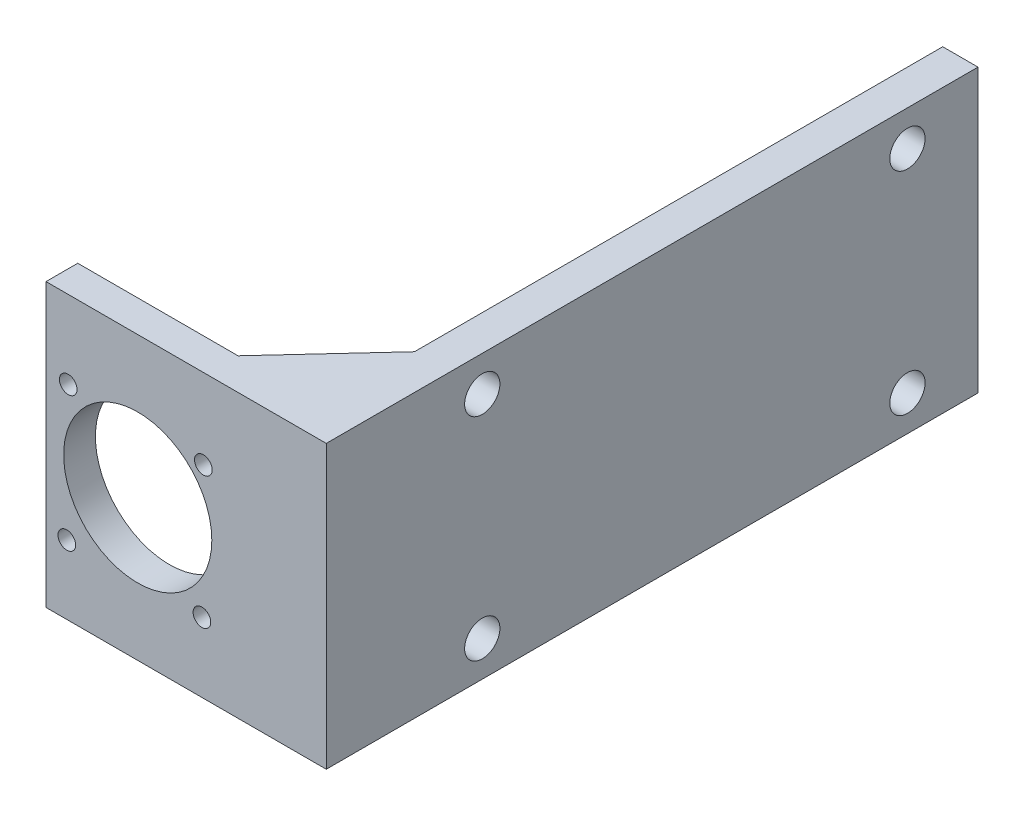
ISO-10303-21;
HEADER;
FILE_DESCRIPTION(('STEP AP214'),'2;1');
FILE_NAME('part.step','',(''),(''),'','','');
FILE_SCHEMA(('AUTOMOTIVE_DESIGN { 1 0 10303 214 1 1 1 1 }'));
ENDSEC;
DATA;
#1=APPLICATION_CONTEXT('core data for automotive mechanical design processes');
#2=APPLICATION_PROTOCOL_DEFINITION('international standard','automotive_design',2000,#1);
#3=PRODUCT_CONTEXT('',#1,'mechanical');
#4=PRODUCT('Part','Part','',(#3));
#5=PRODUCT_RELATED_PRODUCT_CATEGORY('part','',(#4));
#6=PRODUCT_DEFINITION_FORMATION('','',#4);
#7=PRODUCT_DEFINITION_CONTEXT('part definition',#1,'design');
#8=PRODUCT_DEFINITION('design','',#6,#7);
#9=PRODUCT_DEFINITION_SHAPE('','',#8);
#10=(LENGTH_UNIT() NAMED_UNIT(*) SI_UNIT(.MILLI.,.METRE.));
#11=(NAMED_UNIT(*) PLANE_ANGLE_UNIT() SI_UNIT($,.RADIAN.));
#12=(NAMED_UNIT(*) SI_UNIT($,.STERADIAN.) SOLID_ANGLE_UNIT());
#13=UNCERTAINTY_MEASURE_WITH_UNIT(LENGTH_MEASURE(1.E-05),#10,'distance_accuracy_value','');
#14=(GEOMETRIC_REPRESENTATION_CONTEXT(3) GLOBAL_UNCERTAINTY_ASSIGNED_CONTEXT((#13)) GLOBAL_UNIT_ASSIGNED_CONTEXT((#10,
#11,#12)) REPRESENTATION_CONTEXT('',''));
#15=CARTESIAN_POINT('',(0.,0.,0.));
#16=DIRECTION('',(0.,0.,1.));
#17=DIRECTION('',(1.,0.,0.));
#18=AXIS2_PLACEMENT_3D('',#15,#16,#17);
#19=CARTESIAN_POINT('',(8.71999999999915,34.,-13.));
#20=DIRECTION('',(0.734803444627488,0.,0.678280102733066));
#21=DIRECTION('',(0.678280102733066,0.,-0.734803444627488));
#22=AXIS2_PLACEMENT_3D('',#19,#20,#21);
#23=PLANE('',#22);
#24=DIRECTION('',(-0.678280102733066,0.,0.734803444627488));
#25=VECTOR('',#24,1.);
#26=CARTESIAN_POINT('',(8.71999999999915,-3.,-13.));
#27=LINE('',#26,#25);
#28=CARTESIAN_POINT('',(8.71999999999915,-3.,-13.));
#29=VERTEX_POINT('',#28);
#30=CARTESIAN_POINT('',(-3.28000000000085,-3.,0.));
#31=VERTEX_POINT('',#30);
#32=EDGE_CURVE('E118',#29,#31,#27,.T.);
#33=ORIENTED_EDGE('',*,*,#32,.F.);
#34=DIRECTION('',(0.,-1.,0.));
#35=VECTOR('',#34,1.);
#36=CARTESIAN_POINT('',(8.71999999999915,34.,-13.));
#37=LINE('',#36,#35);
#38=CARTESIAN_POINT('',(8.71999999999914,-6.,-13.));
#39=VERTEX_POINT('',#38);
#40=EDGE_CURVE('E126',#29,#39,#37,.T.);
#41=ORIENTED_EDGE('',*,*,#40,.T.);
#42=DIRECTION('',(-0.678280102733066,0.,0.734803444627488));
#43=VECTOR('',#42,1.);
#44=CARTESIAN_POINT('',(8.71999999999915,-6.00000000000001,-13.));
#45=LINE('',#44,#43);
#46=CARTESIAN_POINT('',(-3.28000000000085,-6.,0.));
#47=VERTEX_POINT('',#46);
#48=EDGE_CURVE('E121',#39,#47,#45,.T.);
#49=ORIENTED_EDGE('',*,*,#48,.T.);
#50=DIRECTION('',(0.,-1.,0.));
#51=VECTOR('',#50,1.);
#52=CARTESIAN_POINT('',(-3.28000000000085,34.,0.));
#53=LINE('',#52,#51);
#54=EDGE_CURVE('E128',#31,#47,#53,.T.);
#55=ORIENTED_EDGE('',*,*,#54,.F.);
#56=EDGE_LOOP('',(#33,#41,#49,#55));
#57=FACE_BOUND('',#56,.T.);
#58=ADVANCED_FACE('F35',(#57),#23,.F.);
#59=DIRECTION('',(0.678280102733066,0.,-0.734803444627488));
#60=VECTOR('',#59,1.);
#61=CARTESIAN_POINT('',(8.71999999999915,31.,-13.));
#62=LINE('',#61,#60);
#63=CARTESIAN_POINT('',(-3.28000000000085,31.,0.));
#64=VERTEX_POINT('',#63);
#65=CARTESIAN_POINT('',(8.71999999999915,31.,-13.));
#66=VERTEX_POINT('',#65);
#67=EDGE_CURVE('E130',#64,#66,#62,.T.);
#68=ORIENTED_EDGE('',*,*,#67,.F.);
#69=CARTESIAN_POINT('',(-3.28000000000085,34.,0.));
#70=VERTEX_POINT('',#69);
#71=EDGE_CURVE('E138',#70,#64,#53,.T.);
#72=ORIENTED_EDGE('',*,*,#71,.F.);
#73=DIRECTION('',(-0.678280102733066,0.,0.734803444627488));
#74=VECTOR('',#73,1.);
#75=CARTESIAN_POINT('',(8.71999999999915,34.,-13.));
#76=LINE('',#75,#74);
#77=CARTESIAN_POINT('',(8.71999999999915,34.,-13.));
#78=VERTEX_POINT('',#77);
#79=EDGE_CURVE('E257',#78,#70,#76,.T.);
#80=ORIENTED_EDGE('',*,*,#79,.F.);
#81=EDGE_CURVE('E137',#78,#66,#37,.T.);
#82=ORIENTED_EDGE('',*,*,#81,.T.);
#83=EDGE_LOOP('',(#68,#72,#80,#82));
#84=FACE_BOUND('',#83,.T.);
#85=ADVANCED_FACE('F275',(#84),#23,.F.);
#86=CARTESIAN_POINT('',(0.,0.,0.));
#87=DIRECTION('',(0.,0.,-1.));
#88=DIRECTION('',(-1.,0.,0.));
#89=AXIS2_PLACEMENT_3D('',#86,#87,#88);
#90=PLANE('',#89);
#91=DIRECTION('',(1.,0.,0.));
#92=VECTOR('',#91,1.);
#93=CARTESIAN_POINT('',(8.71999999999915,31.,0.));
#94=LINE('',#93,#92);
#95=CARTESIAN_POINT('',(3.71999999999915,31.,0.));
#96=VERTEX_POINT('',#95);
#97=EDGE_CURVE('E250',#64,#96,#94,.T.);
#98=ORIENTED_EDGE('',*,*,#97,.T.);
#99=DIRECTION('',(0.,-1.,0.));
#100=VECTOR('',#99,1.);
#101=CARTESIAN_POINT('',(3.71999999999914,0.,0.));
#102=LINE('',#101,#100);
#103=CARTESIAN_POINT('',(3.71999999999914,-3.,0.));
#104=VERTEX_POINT('',#103);
#105=EDGE_CURVE('E129',#96,#104,#102,.T.);
#106=ORIENTED_EDGE('',*,*,#105,.T.);
#107=DIRECTION('',(-1.,0.,0.));
#108=VECTOR('',#107,1.);
#109=CARTESIAN_POINT('',(8.71999999999915,-3.,0.));
#110=LINE('',#109,#108);
#111=EDGE_CURVE('E249',#104,#31,#110,.T.);
#112=ORIENTED_EDGE('',*,*,#111,.T.);
#113=ORIENTED_EDGE('',*,*,#54,.T.);
#114=DIRECTION('',(1.,0.,0.));
#115=VECTOR('',#114,1.);
#116=CARTESIAN_POINT('',(0.,-6.,0.));
#117=LINE('',#116,#115);
#118=CARTESIAN_POINT('',(-26.,-6.,0.));
#119=VERTEX_POINT('',#118);
#120=EDGE_CURVE('E228',#119,#47,#117,.T.);
#121=ORIENTED_EDGE('',*,*,#120,.F.);
#122=DIRECTION('',(0.,-1.,0.));
#123=VECTOR('',#122,1.);
#124=CARTESIAN_POINT('',(-26.,-6.,0.));
#125=LINE('',#124,#123);
#126=CARTESIAN_POINT('',(-26.,34.,0.));
#127=VERTEX_POINT('',#126);
#128=EDGE_CURVE('E212',#127,#119,#125,.T.);
#129=ORIENTED_EDGE('',*,*,#128,.F.);
#130=DIRECTION('',(-1.,0.,0.));
#131=VECTOR('',#130,1.);
#132=CARTESIAN_POINT('',(-26.,34.,0.));
#133=LINE('',#132,#131);
#134=EDGE_CURVE('E219',#70,#127,#133,.T.);
#135=ORIENTED_EDGE('',*,*,#134,.F.);
#136=ORIENTED_EDGE('',*,*,#71,.T.);
#137=EDGE_LOOP('',(#98,#106,#112,#113,#121,#129,#135,#136));
#138=FACE_BOUND('',#137,.T.);
#139=CARTESIAN_POINT('',(-13.,14.,0.));
#140=DIRECTION('',(0.,0.,1.));
#141=DIRECTION('',(1.,0.,0.));
#142=AXIS2_PLACEMENT_3D('',#139,#140,#141);
#143=CIRCLE('',#142,10.5);
#144=CARTESIAN_POINT('',(-2.5,14.,0.));
#145=VERTEX_POINT('',#144);
#146=EDGE_CURVE('E206',#145,#145,#143,.T.);
#147=ORIENTED_EDGE('',*,*,#146,.T.);
#148=EDGE_LOOP('',(#147));
#149=FACE_BOUND('',#148,.T.);
#150=CARTESIAN_POINT('',(-3.9,3.85,0.));
#151=DIRECTION('',(0.,0.,1.));
#152=DIRECTION('',(1.,0.,0.));
#153=AXIS2_PLACEMENT_3D('',#150,#151,#152);
#154=CIRCLE('',#153,1.25);
#155=CARTESIAN_POINT('',(-2.65,3.85,0.));
#156=VERTEX_POINT('',#155);
#157=EDGE_CURVE('E200',#156,#156,#154,.T.);
#158=ORIENTED_EDGE('',*,*,#157,.T.);
#159=EDGE_LOOP('',(#158));
#160=FACE_BOUND('',#159,.T.);
#161=CARTESIAN_POINT('',(-22.85,22.95,0.));
#162=DIRECTION('',(0.,0.,1.));
#163=DIRECTION('',(1.,0.,0.));
#164=AXIS2_PLACEMENT_3D('',#161,#162,#163);
#165=CIRCLE('',#164,1.25);
#166=CARTESIAN_POINT('',(-21.6,22.95,0.));
#167=VERTEX_POINT('',#166);
#168=EDGE_CURVE('E188',#167,#167,#165,.T.);
#169=ORIENTED_EDGE('',*,*,#168,.T.);
#170=EDGE_LOOP('',(#169));
#171=FACE_BOUND('',#170,.T.);
#172=CARTESIAN_POINT('',(-23.05,3.75,0.));
#173=DIRECTION('',(0.,0.,1.));
#174=DIRECTION('',(1.,0.,0.));
#175=AXIS2_PLACEMENT_3D('',#172,#173,#174);
#176=CIRCLE('',#175,1.25);
#177=CARTESIAN_POINT('',(-21.8,3.75,0.));
#178=VERTEX_POINT('',#177);
#179=EDGE_CURVE('E194',#178,#178,#176,.T.);
#180=ORIENTED_EDGE('',*,*,#179,.T.);
#181=EDGE_LOOP('',(#180));
#182=FACE_BOUND('',#181,.T.);
#183=CARTESIAN_POINT('',(-3.7,22.65,0.));
#184=DIRECTION('',(0.,0.,1.));
#185=DIRECTION('',(1.,0.,0.));
#186=AXIS2_PLACEMENT_3D('',#183,#184,#185);
#187=CIRCLE('',#186,1.25);
#188=CARTESIAN_POINT('',(-2.45,22.65,0.));
#189=VERTEX_POINT('',#188);
#190=EDGE_CURVE('E179',#189,#189,#187,.T.);
#191=ORIENTED_EDGE('',*,*,#190,.T.);
#192=EDGE_LOOP('',(#191));
#193=FACE_BOUND('',#192,.T.);
#194=ADVANCED_FACE('F247',(#138,#149,#160,#171,#182,#193),#90,.T.);
#195=CARTESIAN_POINT('',(8.71999999999915,34.,-128.181096139102));
#196=DIRECTION('',(1.,0.,0.));
#197=DIRECTION('',(0.,1.,0.));
#198=AXIS2_PLACEMENT_3D('',#195,#196,#197);
#199=PLANE('',#198);
#200=CARTESIAN_POINT('',(8.71999999999915,29.0000000000111,-77.8698073976093));
#201=DIRECTION('',(-1.,0.,0.));
#202=DIRECTION('',(0.,-1.,0.));
#203=AXIS2_PLACEMENT_3D('',#200,#201,#202);
#204=CIRCLE('',#203,2.50000000000662);
#205=CARTESIAN_POINT('',(8.71999999999915,26.5000000000045,-77.8698073976093));
#206=VERTEX_POINT('',#205);
#207=EDGE_CURVE('E149',#206,#206,#204,.T.);
#208=ORIENTED_EDGE('',*,*,#207,.F.);
#209=EDGE_LOOP('',(#208));
#210=FACE_BOUND('',#209,.T.);
#211=CARTESIAN_POINT('',(8.71999999999914,-0.999999999988845,-77.8698073976093));
#212=DIRECTION('',(-1.,0.,0.));
#213=DIRECTION('',(0.,-1.,0.));
#214=AXIS2_PLACEMENT_3D('',#211,#212,#213);
#215=CIRCLE('',#214,2.50000000000662);
#216=CARTESIAN_POINT('',(8.71999999999914,-3.49999999999546,-77.8698073976093));
#217=VERTEX_POINT('',#216);
#218=EDGE_CURVE('E150',#217,#217,#215,.T.);
#219=ORIENTED_EDGE('',*,*,#218,.F.);
#220=EDGE_LOOP('',(#219));
#221=FACE_BOUND('',#220,.T.);
#222=CARTESIAN_POINT('',(8.71999999999914,-0.999999999988859,-17.6098073976093));
#223=DIRECTION('',(-1.,0.,0.));
#224=DIRECTION('',(0.,-1.,0.));
#225=AXIS2_PLACEMENT_3D('',#222,#223,#224);
#226=CIRCLE('',#225,2.50000000000658);
#227=CARTESIAN_POINT('',(8.71999999999914,-3.49999999999543,-17.6098073976093));
#228=VERTEX_POINT('',#227);
#229=EDGE_CURVE('E156',#228,#228,#226,.T.);
#230=ORIENTED_EDGE('',*,*,#229,.F.);
#231=EDGE_LOOP('',(#230));
#232=FACE_BOUND('',#231,.T.);
#233=CARTESIAN_POINT('',(8.71999999999915,29.0000000000111,-17.6098073976093));
#234=DIRECTION('',(-1.,0.,0.));
#235=DIRECTION('',(0.,-1.,0.));
#236=AXIS2_PLACEMENT_3D('',#233,#234,#235);
#237=CIRCLE('',#236,2.50000000000659);
#238=CARTESIAN_POINT('',(8.71999999999915,26.5000000000046,-17.6098073976093));
#239=VERTEX_POINT('',#238);
#240=EDGE_CURVE('E141',#239,#239,#237,.T.);
#241=ORIENTED_EDGE('',*,*,#240,.F.);
#242=EDGE_LOOP('',(#241));
#243=FACE_BOUND('',#242,.T.);
#244=DIRECTION('',(0.,0.,1.));
#245=VECTOR('',#244,1.);
#246=CARTESIAN_POINT('',(8.71999999999915,-3.,-13.));
#247=LINE('',#246,#245);
#248=CARTESIAN_POINT('',(8.71999999999915,-3.,-5.));
#249=VERTEX_POINT('',#248);
#250=EDGE_CURVE('E115',#29,#249,#247,.T.);
#251=ORIENTED_EDGE('',*,*,#250,.T.);
#252=DIRECTION('',(0.,-1.,0.));
#253=VECTOR('',#252,1.);
#254=CARTESIAN_POINT('',(8.71999999999915,34.,-5.));
#255=LINE('',#254,#253);
#256=CARTESIAN_POINT('',(8.71999999999915,31.,-5.));
#257=VERTEX_POINT('',#256);
#258=EDGE_CURVE('E43',#249,#257,#255,.F.);
#259=ORIENTED_EDGE('',*,*,#258,.T.);
#260=DIRECTION('',(0.,0.,1.));
#261=VECTOR('',#260,1.);
#262=CARTESIAN_POINT('',(8.71999999999915,31.,-13.));
#263=LINE('',#262,#261);
#264=EDGE_CURVE('E122',#66,#257,#263,.T.);
#265=ORIENTED_EDGE('',*,*,#264,.F.);
#266=ORIENTED_EDGE('',*,*,#81,.F.);
#267=DIRECTION('',(0.,0.,1.));
#268=VECTOR('',#267,1.);
#269=CARTESIAN_POINT('',(8.71999999999915,34.,-128.181096139102));
#270=LINE('',#269,#268);
#271=CARTESIAN_POINT('',(8.71999999999915,34.,-87.8698073976093));
#272=VERTEX_POINT('',#271);
#273=EDGE_CURVE('E167',#272,#78,#270,.T.);
#274=ORIENTED_EDGE('',*,*,#273,.F.);
#275=DIRECTION('',(0.,-1.,0.));
#276=VECTOR('',#275,1.);
#277=CARTESIAN_POINT('',(8.71999999999915,34.,-87.8698073976093));
#278=LINE('',#277,#276);
#279=CARTESIAN_POINT('',(8.71999999999914,-6.,-87.8698073976093));
#280=VERTEX_POINT('',#279);
#281=EDGE_CURVE('E170',#272,#280,#278,.T.);
#282=ORIENTED_EDGE('',*,*,#281,.T.);
#283=DIRECTION('',(0.,0.,1.));
#284=VECTOR('',#283,1.);
#285=CARTESIAN_POINT('',(8.71999999999914,-6.,-128.181096139102));
#286=LINE('',#285,#284);
#287=EDGE_CURVE('E135',#280,#39,#286,.T.);
#288=ORIENTED_EDGE('',*,*,#287,.T.);
#289=ORIENTED_EDGE('',*,*,#40,.F.);
#290=EDGE_LOOP('',(#251,#259,#265,#266,#274,#282,#288,#289));
#291=FACE_BOUND('',#290,.T.);
#292=ADVANCED_FACE('F132',(#210,#221,#232,#243,#291),#199,.F.);
#293=CARTESIAN_POINT('',(0.,0.,4.5));
#294=DIRECTION('',(0.,0.,-1.));
#295=DIRECTION('',(-1.,0.,0.));
#296=AXIS2_PLACEMENT_3D('',#293,#294,#295);
#297=PLANE('',#296);
#298=DIRECTION('',(0.,-1.,0.));
#299=VECTOR('',#298,1.);
#300=CARTESIAN_POINT('',(-26.,-6.,4.5));
#301=LINE('',#300,#299);
#302=CARTESIAN_POINT('',(-26.,34.,4.5));
#303=VERTEX_POINT('',#302);
#304=CARTESIAN_POINT('',(-26.,-6.,4.5));
#305=VERTEX_POINT('',#304);
#306=EDGE_CURVE('E215',#303,#305,#301,.T.);
#307=ORIENTED_EDGE('',*,*,#306,.T.);
#308=DIRECTION('',(1.,0.,0.));
#309=VECTOR('',#308,1.);
#310=CARTESIAN_POINT('',(-26.,-6.,4.5));
#311=LINE('',#310,#309);
#312=CARTESIAN_POINT('',(13.7199999999991,-6.,4.5));
#313=VERTEX_POINT('',#312);
#314=EDGE_CURVE('E218',#305,#313,#311,.T.);
#315=ORIENTED_EDGE('',*,*,#314,.T.);
#316=DIRECTION('',(0.,1.,0.));
#317=VECTOR('',#316,1.);
#318=CARTESIAN_POINT('',(13.7199999999991,-6.,4.5));
#319=LINE('',#318,#317);
#320=CARTESIAN_POINT('',(13.7199999999991,34.,4.5));
#321=VERTEX_POINT('',#320);
#322=EDGE_CURVE('E221',#313,#321,#319,.T.);
#323=ORIENTED_EDGE('',*,*,#322,.T.);
#324=DIRECTION('',(-1.,0.,0.));
#325=VECTOR('',#324,1.);
#326=CARTESIAN_POINT('',(0.,34.,4.5));
#327=LINE('',#326,#325);
#328=EDGE_CURVE('E223',#321,#303,#327,.T.);
#329=ORIENTED_EDGE('',*,*,#328,.T.);
#330=EDGE_LOOP('',(#307,#315,#323,#329));
#331=FACE_BOUND('',#330,.T.);
#332=CARTESIAN_POINT('',(-13.,14.,4.5));
#333=DIRECTION('',(0.,0.,1.));
#334=DIRECTION('',(1.,0.,0.));
#335=AXIS2_PLACEMENT_3D('',#332,#333,#334);
#336=CIRCLE('',#335,10.5);
#337=CARTESIAN_POINT('',(-2.5,14.,4.5));
#338=VERTEX_POINT('',#337);
#339=EDGE_CURVE('E209',#338,#338,#336,.T.);
#340=ORIENTED_EDGE('',*,*,#339,.F.);
#341=EDGE_LOOP('',(#340));
#342=FACE_BOUND('',#341,.T.);
#343=CARTESIAN_POINT('',(-3.9,3.85,4.5));
#344=DIRECTION('',(0.,0.,1.));
#345=DIRECTION('',(1.,0.,0.));
#346=AXIS2_PLACEMENT_3D('',#343,#344,#345);
#347=CIRCLE('',#346,1.25);
#348=CARTESIAN_POINT('',(-2.65,3.85,4.5));
#349=VERTEX_POINT('',#348);
#350=EDGE_CURVE('E203',#349,#349,#347,.T.);
#351=ORIENTED_EDGE('',*,*,#350,.F.);
#352=EDGE_LOOP('',(#351));
#353=FACE_BOUND('',#352,.T.);
#354=CARTESIAN_POINT('',(-23.05,3.75,4.5));
#355=DIRECTION('',(0.,0.,1.));
#356=DIRECTION('',(1.,0.,0.));
#357=AXIS2_PLACEMENT_3D('',#354,#355,#356);
#358=CIRCLE('',#357,1.25);
#359=CARTESIAN_POINT('',(-21.8,3.75,4.5));
#360=VERTEX_POINT('',#359);
#361=EDGE_CURVE('E197',#360,#360,#358,.T.);
#362=ORIENTED_EDGE('',*,*,#361,.F.);
#363=EDGE_LOOP('',(#362));
#364=FACE_BOUND('',#363,.T.);
#365=CARTESIAN_POINT('',(-22.85,22.95,4.5));
#366=DIRECTION('',(0.,0.,1.));
#367=DIRECTION('',(1.,0.,0.));
#368=AXIS2_PLACEMENT_3D('',#365,#366,#367);
#369=CIRCLE('',#368,1.25);
#370=CARTESIAN_POINT('',(-21.6,22.95,4.5));
#371=VERTEX_POINT('',#370);
#372=EDGE_CURVE('E191',#371,#371,#369,.T.);
#373=ORIENTED_EDGE('',*,*,#372,.F.);
#374=EDGE_LOOP('',(#373));
#375=FACE_BOUND('',#374,.T.);
#376=CARTESIAN_POINT('',(-3.7,22.65,4.5));
#377=DIRECTION('',(0.,0.,1.));
#378=DIRECTION('',(1.,0.,0.));
#379=AXIS2_PLACEMENT_3D('',#376,#377,#378);
#380=CIRCLE('',#379,1.25);
#381=CARTESIAN_POINT('',(-2.45,22.65,4.5));
#382=VERTEX_POINT('',#381);
#383=EDGE_CURVE('E185',#382,#382,#380,.T.);
#384=ORIENTED_EDGE('',*,*,#383,.F.);
#385=EDGE_LOOP('',(#384));
#386=FACE_BOUND('',#385,.T.);
#387=ADVANCED_FACE('F288',(#331,#342,#353,#364,#375,#386),#297,.F.);
#388=CARTESIAN_POINT('',(-26.,-6.,4.5));
#389=DIRECTION('',(1.,0.,0.));
#390=DIRECTION('',(0.,0.,-1.));
#391=AXIS2_PLACEMENT_3D('',#388,#389,#390);
#392=PLANE('',#391);
#393=ORIENTED_EDGE('',*,*,#128,.T.);
#394=DIRECTION('',(0.,0.,-1.));
#395=VECTOR('',#394,1.);
#396=CARTESIAN_POINT('',(-26.,-6.,4.5));
#397=LINE('',#396,#395);
#398=EDGE_CURVE('E238',#305,#119,#397,.T.);
#399=ORIENTED_EDGE('',*,*,#398,.F.);
#400=ORIENTED_EDGE('',*,*,#306,.F.);
#401=DIRECTION('',(0.,0.,-1.));
#402=VECTOR('',#401,1.);
#403=CARTESIAN_POINT('',(-26.,34.,4.5));
#404=LINE('',#403,#402);
#405=EDGE_CURVE('E225',#303,#127,#404,.T.);
#406=ORIENTED_EDGE('',*,*,#405,.T.);
#407=EDGE_LOOP('',(#393,#399,#400,#406));
#408=FACE_BOUND('',#407,.T.);
#409=ADVANCED_FACE('F264',(#408),#392,.F.);
#410=CARTESIAN_POINT('',(0.,-6.,4.5));
#411=DIRECTION('',(0.,1.,0.));
#412=DIRECTION('',(0.,0.,1.));
#413=AXIS2_PLACEMENT_3D('',#410,#411,#412);
#414=PLANE('',#413);
#415=ORIENTED_EDGE('',*,*,#120,.T.);
#416=ORIENTED_EDGE('',*,*,#48,.F.);
#417=ORIENTED_EDGE('',*,*,#287,.F.);
#418=DIRECTION('',(1.,0.,0.));
#419=VECTOR('',#418,1.);
#420=CARTESIAN_POINT('',(13.7199999999991,-6.,-87.8698073976093));
#421=LINE('',#420,#419);
#422=CARTESIAN_POINT('',(13.7199999999991,-6.,-87.8698073976093));
#423=VERTEX_POINT('',#422);
#424=EDGE_CURVE('E172',#280,#423,#421,.T.);
#425=ORIENTED_EDGE('',*,*,#424,.T.);
#426=DIRECTION('',(0.,0.,-1.));
#427=VECTOR('',#426,1.);
#428=CARTESIAN_POINT('',(13.7199999999991,-6.,4.5));
#429=LINE('',#428,#427);
#430=EDGE_CURVE('E236',#313,#423,#429,.T.);
#431=ORIENTED_EDGE('',*,*,#430,.F.);
#432=ORIENTED_EDGE('',*,*,#314,.F.);
#433=ORIENTED_EDGE('',*,*,#398,.T.);
#434=EDGE_LOOP('',(#415,#416,#417,#425,#431,#432,#433));
#435=FACE_BOUND('',#434,.T.);
#436=ADVANCED_FACE('F260',(#435),#414,.F.);
#437=CARTESIAN_POINT('',(13.7199999999991,-6.,4.5));
#438=DIRECTION('',(-1.,0.,0.));
#439=DIRECTION('',(0.,0.,1.));
#440=AXIS2_PLACEMENT_3D('',#437,#438,#439);
#441=PLANE('',#440);
#442=CARTESIAN_POINT('',(13.7199999999992,29.0000000000111,-17.6098073976093));
#443=DIRECTION('',(-1.,0.,0.));
#444=DIRECTION('',(0.,-1.,0.));
#445=AXIS2_PLACEMENT_3D('',#442,#443,#444);
#446=CIRCLE('',#445,2.50000000000659);
#447=CARTESIAN_POINT('',(13.7199999999992,26.5000000000046,-17.6098073976093));
#448=VERTEX_POINT('',#447);
#449=EDGE_CURVE('E159',#448,#448,#446,.T.);
#450=ORIENTED_EDGE('',*,*,#449,.T.);
#451=EDGE_LOOP('',(#450));
#452=FACE_BOUND('',#451,.T.);
#453=CARTESIAN_POINT('',(13.7199999999991,-0.99999999998886,-17.6098073976093));
#454=DIRECTION('',(-1.,0.,0.));
#455=DIRECTION('',(0.,-1.,0.));
#456=AXIS2_PLACEMENT_3D('',#453,#454,#455);
#457=CIRCLE('',#456,2.50000000000658);
#458=CARTESIAN_POINT('',(13.7199999999991,-3.49999999999544,-17.6098073976093));
#459=VERTEX_POINT('',#458);
#460=EDGE_CURVE('E153',#459,#459,#457,.T.);
#461=ORIENTED_EDGE('',*,*,#460,.T.);
#462=EDGE_LOOP('',(#461));
#463=FACE_BOUND('',#462,.T.);
#464=CARTESIAN_POINT('',(13.7199999999991,-0.999999999988846,-77.8698073976093));
#465=DIRECTION('',(-1.,0.,0.));
#466=DIRECTION('',(0.,-1.,0.));
#467=AXIS2_PLACEMENT_3D('',#464,#465,#466);
#468=CIRCLE('',#467,2.50000000000662);
#469=CARTESIAN_POINT('',(13.7199999999991,-3.49999999999546,-77.8698073976093));
#470=VERTEX_POINT('',#469);
#471=EDGE_CURVE('E146',#470,#470,#468,.T.);
#472=ORIENTED_EDGE('',*,*,#471,.T.);
#473=EDGE_LOOP('',(#472));
#474=FACE_BOUND('',#473,.T.);
#475=CARTESIAN_POINT('',(13.7199999999992,29.0000000000111,-77.8698073976093));
#476=DIRECTION('',(-1.,0.,0.));
#477=DIRECTION('',(0.,-1.,0.));
#478=AXIS2_PLACEMENT_3D('',#475,#476,#477);
#479=CIRCLE('',#478,2.50000000000662);
#480=CARTESIAN_POINT('',(13.7199999999992,26.5000000000045,-77.8698073976093));
#481=VERTEX_POINT('',#480);
#482=EDGE_CURVE('E164',#481,#481,#479,.T.);
#483=ORIENTED_EDGE('',*,*,#482,.T.);
#484=EDGE_LOOP('',(#483));
#485=FACE_BOUND('',#484,.T.);
#486=ORIENTED_EDGE('',*,*,#430,.T.);
#487=DIRECTION('',(0.,1.,0.));
#488=VECTOR('',#487,1.);
#489=CARTESIAN_POINT('',(13.7199999999991,34.,-87.8698073976093));
#490=LINE('',#489,#488);
#491=CARTESIAN_POINT('',(13.7199999999991,34.,-87.8698073976093));
#492=VERTEX_POINT('',#491);
#493=EDGE_CURVE('E176',#423,#492,#490,.T.);
#494=ORIENTED_EDGE('',*,*,#493,.T.);
#495=DIRECTION('',(0.,0.,-1.));
#496=VECTOR('',#495,1.);
#497=CARTESIAN_POINT('',(13.7199999999991,34.,4.5));
#498=LINE('',#497,#496);
#499=EDGE_CURVE('E234',#321,#492,#498,.T.);
#500=ORIENTED_EDGE('',*,*,#499,.F.);
#501=ORIENTED_EDGE('',*,*,#322,.F.);
#502=EDGE_LOOP('',(#486,#494,#500,#501));
#503=FACE_BOUND('',#502,.T.);
#504=ADVANCED_FACE('F284',(#452,#463,#474,#485,#503),#441,.F.);
#505=CARTESIAN_POINT('',(-26.,34.,4.5));
#506=DIRECTION('',(0.,-1.,0.));
#507=DIRECTION('',(0.,0.,-1.));
#508=AXIS2_PLACEMENT_3D('',#505,#506,#507);
#509=PLANE('',#508);
#510=ORIENTED_EDGE('',*,*,#79,.T.);
#511=ORIENTED_EDGE('',*,*,#134,.T.);
#512=ORIENTED_EDGE('',*,*,#405,.F.);
#513=ORIENTED_EDGE('',*,*,#328,.F.);
#514=ORIENTED_EDGE('',*,*,#499,.T.);
#515=DIRECTION('',(-1.,0.,0.));
#516=VECTOR('',#515,1.);
#517=CARTESIAN_POINT('',(13.7199999999991,34.,-87.8698073976093));
#518=LINE('',#517,#516);
#519=EDGE_CURVE('E173',#492,#272,#518,.T.);
#520=ORIENTED_EDGE('',*,*,#519,.T.);
#521=ORIENTED_EDGE('',*,*,#273,.T.);
#522=EDGE_LOOP('',(#510,#511,#512,#513,#514,#520,#521));
#523=FACE_BOUND('',#522,.T.);
#524=ADVANCED_FACE('F269',(#523),#509,.F.);
#525=CARTESIAN_POINT('',(-13.,14.,4.5));
#526=DIRECTION('',(0.,0.,-1.));
#527=DIRECTION('',(-1.,0.,0.));
#528=AXIS2_PLACEMENT_3D('',#525,#526,#527);
#529=CYLINDRICAL_SURFACE('',#528,10.5);
#530=ORIENTED_EDGE('',*,*,#339,.T.);
#531=EDGE_LOOP('',(#530));
#532=FACE_BOUND('',#531,.T.);
#533=ORIENTED_EDGE('',*,*,#146,.F.);
#534=EDGE_LOOP('',(#533));
#535=FACE_BOUND('',#534,.T.);
#536=ADVANCED_FACE('F353',(#532,#535),#529,.F.);
#537=CARTESIAN_POINT('',(-3.9,3.85,4.5));
#538=DIRECTION('',(0.,0.,-1.));
#539=DIRECTION('',(-1.,0.,0.));
#540=AXIS2_PLACEMENT_3D('',#537,#538,#539);
#541=CYLINDRICAL_SURFACE('',#540,1.25);
#542=ORIENTED_EDGE('',*,*,#350,.T.);
#543=EDGE_LOOP('',(#542));
#544=FACE_BOUND('',#543,.T.);
#545=ORIENTED_EDGE('',*,*,#157,.F.);
#546=EDGE_LOOP('',(#545));
#547=FACE_BOUND('',#546,.T.);
#548=ADVANCED_FACE('F349',(#544,#547),#541,.F.);
#549=CARTESIAN_POINT('',(-23.05,3.75,4.5));
#550=DIRECTION('',(0.,0.,-1.));
#551=DIRECTION('',(-1.,0.,0.));
#552=AXIS2_PLACEMENT_3D('',#549,#550,#551);
#553=CYLINDRICAL_SURFACE('',#552,1.25);
#554=ORIENTED_EDGE('',*,*,#361,.T.);
#555=EDGE_LOOP('',(#554));
#556=FACE_BOUND('',#555,.T.);
#557=ORIENTED_EDGE('',*,*,#179,.F.);
#558=EDGE_LOOP('',(#557));
#559=FACE_BOUND('',#558,.T.);
#560=ADVANCED_FACE('F345',(#556,#559),#553,.F.);
#561=CARTESIAN_POINT('',(-22.85,22.95,4.5));
#562=DIRECTION('',(0.,0.,-1.));
#563=DIRECTION('',(-1.,0.,0.));
#564=AXIS2_PLACEMENT_3D('',#561,#562,#563);
#565=CYLINDRICAL_SURFACE('',#564,1.25);
#566=ORIENTED_EDGE('',*,*,#372,.T.);
#567=EDGE_LOOP('',(#566));
#568=FACE_BOUND('',#567,.T.);
#569=ORIENTED_EDGE('',*,*,#168,.F.);
#570=EDGE_LOOP('',(#569));
#571=FACE_BOUND('',#570,.T.);
#572=ADVANCED_FACE('F305',(#568,#571),#565,.F.);
#573=CARTESIAN_POINT('',(-3.7,22.65,4.5));
#574=DIRECTION('',(0.,0.,-1.));
#575=DIRECTION('',(-1.,0.,0.));
#576=AXIS2_PLACEMENT_3D('',#573,#574,#575);
#577=CYLINDRICAL_SURFACE('',#576,1.25);
#578=ORIENTED_EDGE('',*,*,#383,.T.);
#579=EDGE_LOOP('',(#578));
#580=FACE_BOUND('',#579,.T.);
#581=ORIENTED_EDGE('',*,*,#190,.F.);
#582=EDGE_LOOP('',(#581));
#583=FACE_BOUND('',#582,.T.);
#584=ADVANCED_FACE('F302',(#580,#583),#577,.F.);
#585=CARTESIAN_POINT('',(13.7200000000006,-35.9999999999889,-87.8698073976093));
#586=DIRECTION('',(0.,0.,1.));
#587=DIRECTION('',(1.,0.,0.));
#588=AXIS2_PLACEMENT_3D('',#585,#586,#587);
#589=PLANE('',#588);
#590=ORIENTED_EDGE('',*,*,#424,.F.);
#591=ORIENTED_EDGE('',*,*,#281,.F.);
#592=ORIENTED_EDGE('',*,*,#519,.F.);
#593=ORIENTED_EDGE('',*,*,#493,.F.);
#594=EDGE_LOOP('',(#590,#591,#592,#593));
#595=FACE_BOUND('',#594,.T.);
#596=ADVANCED_FACE('F282',(#595),#589,.F.);
#597=CARTESIAN_POINT('',(13.7199999999992,29.0000000000111,-77.8698073976093));
#598=DIRECTION('',(-1.,0.,0.));
#599=DIRECTION('',(0.,-1.,0.));
#600=AXIS2_PLACEMENT_3D('',#597,#598,#599);
#601=CYLINDRICAL_SURFACE('',#600,2.50000000000662);
#602=ORIENTED_EDGE('',*,*,#482,.F.);
#603=EDGE_LOOP('',(#602));
#604=FACE_BOUND('',#603,.T.);
#605=ORIENTED_EDGE('',*,*,#207,.T.);
#606=EDGE_LOOP('',(#605));
#607=FACE_BOUND('',#606,.T.);
#608=ADVANCED_FACE('F329',(#604,#607),#601,.F.);
#609=CARTESIAN_POINT('',(13.7199999999991,-0.999999999988846,-77.8698073976093));
#610=DIRECTION('',(-1.,0.,0.));
#611=DIRECTION('',(0.,-1.,0.));
#612=AXIS2_PLACEMENT_3D('',#609,#610,#611);
#613=CYLINDRICAL_SURFACE('',#612,2.50000000000662);
#614=ORIENTED_EDGE('',*,*,#471,.F.);
#615=EDGE_LOOP('',(#614));
#616=FACE_BOUND('',#615,.T.);
#617=ORIENTED_EDGE('',*,*,#218,.T.);
#618=EDGE_LOOP('',(#617));
#619=FACE_BOUND('',#618,.T.);
#620=ADVANCED_FACE('F325',(#616,#619),#613,.F.);
#621=CARTESIAN_POINT('',(13.7199999999991,-0.99999999998886,-17.6098073976093));
#622=DIRECTION('',(-1.,0.,0.));
#623=DIRECTION('',(0.,-1.,0.));
#624=AXIS2_PLACEMENT_3D('',#621,#622,#623);
#625=CYLINDRICAL_SURFACE('',#624,2.50000000000658);
#626=ORIENTED_EDGE('',*,*,#460,.F.);
#627=EDGE_LOOP('',(#626));
#628=FACE_BOUND('',#627,.T.);
#629=ORIENTED_EDGE('',*,*,#229,.T.);
#630=EDGE_LOOP('',(#629));
#631=FACE_BOUND('',#630,.T.);
#632=ADVANCED_FACE('F328',(#628,#631),#625,.F.);
#633=CARTESIAN_POINT('',(13.7199999999992,29.0000000000111,-17.6098073976093));
#634=DIRECTION('',(-1.,0.,0.));
#635=DIRECTION('',(0.,-1.,0.));
#636=AXIS2_PLACEMENT_3D('',#633,#634,#635);
#637=CYLINDRICAL_SURFACE('',#636,2.50000000000659);
#638=ORIENTED_EDGE('',*,*,#449,.F.);
#639=EDGE_LOOP('',(#638));
#640=FACE_BOUND('',#639,.T.);
#641=ORIENTED_EDGE('',*,*,#240,.T.);
#642=EDGE_LOOP('',(#641));
#643=FACE_BOUND('',#642,.T.);
#644=ADVANCED_FACE('F333',(#640,#643),#637,.F.);
#645=CARTESIAN_POINT('',(8.71999999999915,-3.,-13.));
#646=DIRECTION('',(0.,1.,0.));
#647=DIRECTION('',(-1.,0.,0.));
#648=AXIS2_PLACEMENT_3D('',#645,#646,#647);
#649=PLANE('',#648);
#650=ORIENTED_EDGE('',*,*,#111,.F.);
#651=CARTESIAN_POINT('',(3.71999999999914,-3.,-5.));
#652=DIRECTION('',(0.,1.,0.));
#653=DIRECTION('',(-1.,0.,0.));
#654=AXIS2_PLACEMENT_3D('',#651,#652,#653);
#655=CIRCLE('',#654,5.);
#656=EDGE_CURVE('E57',#104,#249,#655,.T.);
#657=ORIENTED_EDGE('',*,*,#656,.T.);
#658=ORIENTED_EDGE('',*,*,#250,.F.);
#659=ORIENTED_EDGE('',*,*,#32,.T.);
#660=EDGE_LOOP('',(#650,#657,#658,#659));
#661=FACE_BOUND('',#660,.T.);
#662=ADVANCED_FACE('F117',(#661),#649,.T.);
#663=CARTESIAN_POINT('',(8.71999999999915,31.,-13.));
#664=DIRECTION('',(0.,-1.,0.));
#665=DIRECTION('',(1.,0.,0.));
#666=AXIS2_PLACEMENT_3D('',#663,#664,#665);
#667=PLANE('',#666);
#668=ORIENTED_EDGE('',*,*,#264,.T.);
#669=CARTESIAN_POINT('',(3.71999999999915,31.,-5.));
#670=DIRECTION('',(0.,-1.,0.));
#671=DIRECTION('',(1.,0.,0.));
#672=AXIS2_PLACEMENT_3D('',#669,#670,#671);
#673=CIRCLE('',#672,5.);
#674=EDGE_CURVE('E11',#257,#96,#673,.T.);
#675=ORIENTED_EDGE('',*,*,#674,.T.);
#676=ORIENTED_EDGE('',*,*,#97,.F.);
#677=ORIENTED_EDGE('',*,*,#67,.T.);
#678=EDGE_LOOP('',(#668,#675,#676,#677));
#679=FACE_BOUND('',#678,.T.);
#680=ADVANCED_FACE('F277',(#679),#667,.T.);
#681=CARTESIAN_POINT('',(3.71999999999914,0.,-5.));
#682=DIRECTION('',(0.,-1.,0.));
#683=DIRECTION('',(1.,0.,0.));
#684=AXIS2_PLACEMENT_3D('',#681,#682,#683);
#685=CYLINDRICAL_SURFACE('',#684,5.);
#686=ORIENTED_EDGE('',*,*,#674,.F.);
#687=ORIENTED_EDGE('',*,*,#258,.F.);
#688=ORIENTED_EDGE('',*,*,#656,.F.);
#689=ORIENTED_EDGE('',*,*,#105,.F.);
#690=EDGE_LOOP('',(#686,#687,#688,#689));
#691=FACE_BOUND('',#690,.T.);
#692=ADVANCED_FACE('F37',(#691),#685,.F.);
#693=CLOSED_SHELL('',(#58,#85,#194,#292,#387,#409,#436,#504,#524,#536,#548,#560,#572,#584,#596,
#608,#620,#632,#644,#662,#680,#692));
#694=MANIFOLD_SOLID_BREP('B2',#693);
#695=ADVANCED_BREP_SHAPE_REPRESENTATION('',(#18,#694),#14);
#696=SHAPE_DEFINITION_REPRESENTATION(#9,#695);
ENDSEC;
END-ISO-10303-21;
